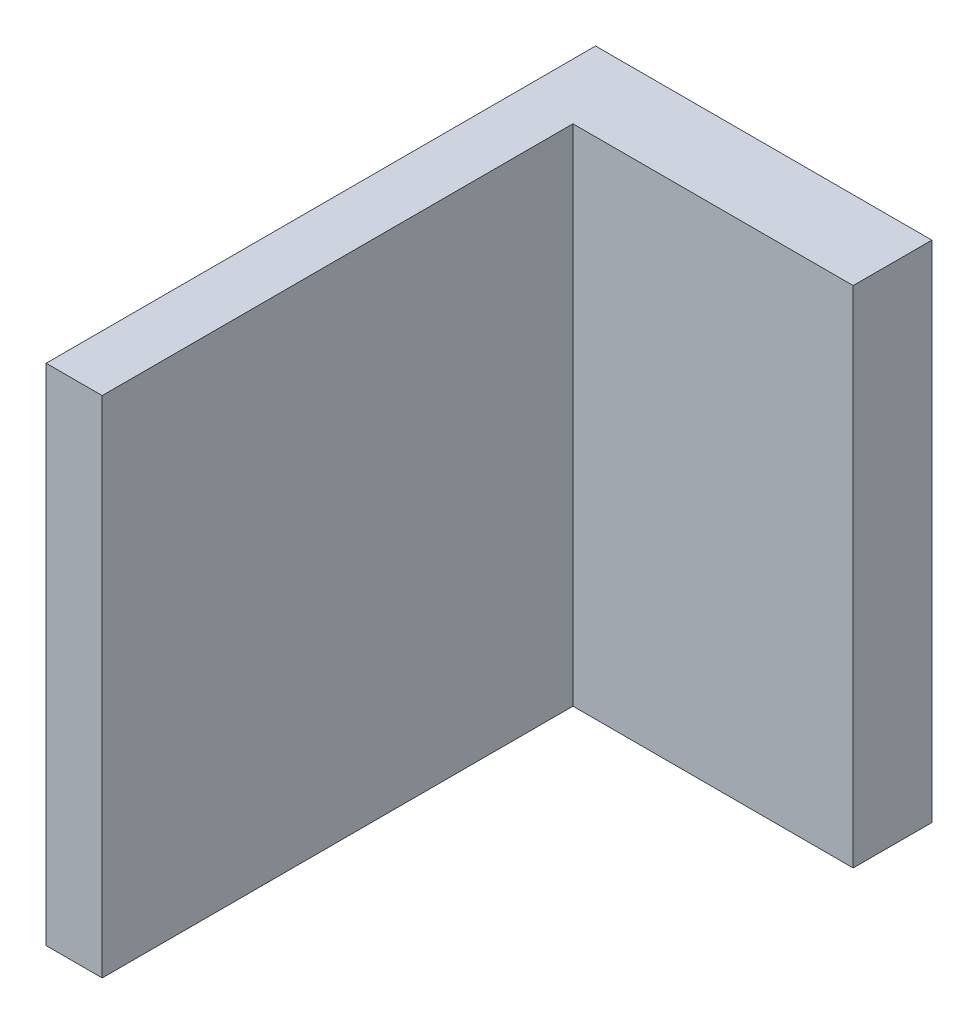
ISO-10303-21;
HEADER;
FILE_DESCRIPTION(('STEP AP214'),'2;1');
FILE_NAME('part.step','',(''),(''),'','','');
FILE_SCHEMA(('AUTOMOTIVE_DESIGN { 1 0 10303 214 1 1 1 1 }'));
ENDSEC;
DATA;
#1=APPLICATION_CONTEXT('core data for automotive mechanical design processes');
#2=APPLICATION_PROTOCOL_DEFINITION('international standard','automotive_design',2000,#1);
#3=PRODUCT_CONTEXT('',#1,'mechanical');
#4=PRODUCT('Part','Part','',(#3));
#5=PRODUCT_RELATED_PRODUCT_CATEGORY('part','',(#4));
#6=PRODUCT_DEFINITION_FORMATION('','',#4);
#7=PRODUCT_DEFINITION_CONTEXT('part definition',#1,'design');
#8=PRODUCT_DEFINITION('design','',#6,#7);
#9=PRODUCT_DEFINITION_SHAPE('','',#8);
#10=(LENGTH_UNIT() NAMED_UNIT(*) SI_UNIT(.MILLI.,.METRE.));
#11=(NAMED_UNIT(*) PLANE_ANGLE_UNIT() SI_UNIT($,.RADIAN.));
#12=(NAMED_UNIT(*) SI_UNIT($,.STERADIAN.) SOLID_ANGLE_UNIT());
#13=UNCERTAINTY_MEASURE_WITH_UNIT(LENGTH_MEASURE(1.E-05),#10,'distance_accuracy_value','');
#14=(GEOMETRIC_REPRESENTATION_CONTEXT(3) GLOBAL_UNCERTAINTY_ASSIGNED_CONTEXT((#13)) GLOBAL_UNIT_ASSIGNED_CONTEXT((#10,
#11,#12)) REPRESENTATION_CONTEXT('',''));
#15=CARTESIAN_POINT('',(0.,0.,0.));
#16=DIRECTION('',(0.,0.,1.));
#17=DIRECTION('',(1.,0.,0.));
#18=AXIS2_PLACEMENT_3D('',#15,#16,#17);
#19=CARTESIAN_POINT('',(1.22065899602321,22.5,10.746464433405));
#20=DIRECTION('',(0.,0.,-1.));
#21=DIRECTION('',(-1.,0.,0.));
#22=AXIS2_PLACEMENT_3D('',#19,#20,#21);
#23=PLANE('',#22);
#24=DIRECTION('',(1.,0.,0.));
#25=VECTOR('',#24,1.);
#26=CARTESIAN_POINT('',(1.22065899602321,0.,10.746464433405));
#27=LINE('',#26,#25);
#28=CARTESIAN_POINT('',(-1.27934100397679,0.,10.746464433405));
#29=VERTEX_POINT('',#28);
#30=CARTESIAN_POINT('',(1.22065899602321,0.,10.746464433405));
#31=VERTEX_POINT('',#30);
#32=EDGE_CURVE('E121',#29,#31,#27,.T.);
#33=ORIENTED_EDGE('',*,*,#32,.T.);
#34=DIRECTION('',(0.,-1.,0.));
#35=VECTOR('',#34,1.);
#36=CARTESIAN_POINT('',(1.22065899602321,22.5,10.746464433405));
#37=LINE('',#36,#35);
#38=CARTESIAN_POINT('',(1.22065899602321,22.5,10.746464433405));
#39=VERTEX_POINT('',#38);
#40=EDGE_CURVE('E41',#39,#31,#37,.T.);
#41=ORIENTED_EDGE('',*,*,#40,.F.);
#42=DIRECTION('',(1.,0.,0.));
#43=VECTOR('',#42,1.);
#44=CARTESIAN_POINT('',(1.22065899602321,22.5,10.746464433405));
#45=LINE('',#44,#43);
#46=CARTESIAN_POINT('',(-1.27934100397679,22.5,10.746464433405));
#47=VERTEX_POINT('',#46);
#48=EDGE_CURVE('E87',#47,#39,#45,.T.);
#49=ORIENTED_EDGE('',*,*,#48,.F.);
#50=DIRECTION('',(0.,-1.,0.));
#51=VECTOR('',#50,1.);
#52=CARTESIAN_POINT('',(-1.27934100397679,22.5,10.746464433405));
#53=LINE('',#52,#51);
#54=EDGE_CURVE('E11',#47,#29,#53,.T.);
#55=ORIENTED_EDGE('',*,*,#54,.T.);
#56=EDGE_LOOP('',(#33,#41,#49,#55));
#57=FACE_BOUND('',#56,.T.);
#58=ADVANCED_FACE('F33',(#57),#23,.F.);
#59=CARTESIAN_POINT('',(1.22065899602321,22.5,-10.253535566595));
#60=DIRECTION('',(-1.,0.,0.));
#61=DIRECTION('',(0.,0.,1.));
#62=AXIS2_PLACEMENT_3D('',#59,#60,#61);
#63=PLANE('',#62);
#64=DIRECTION('',(0.,0.,-1.));
#65=VECTOR('',#64,1.);
#66=CARTESIAN_POINT('',(1.22065899602321,0.,-10.253535566595));
#67=LINE('',#66,#65);
#68=CARTESIAN_POINT('',(1.22065899602321,0.,-10.253535566595));
#69=VERTEX_POINT('',#68);
#70=EDGE_CURVE('E123',#31,#69,#67,.T.);
#71=ORIENTED_EDGE('',*,*,#70,.T.);
#72=DIRECTION('',(0.,-1.,0.));
#73=VECTOR('',#72,1.);
#74=CARTESIAN_POINT('',(1.22065899602321,22.5,-10.253535566595));
#75=LINE('',#74,#73);
#76=CARTESIAN_POINT('',(1.22065899602321,22.5,-10.253535566595));
#77=VERTEX_POINT('',#76);
#78=EDGE_CURVE('E110',#77,#69,#75,.T.);
#79=ORIENTED_EDGE('',*,*,#78,.F.);
#80=DIRECTION('',(0.,0.,-1.));
#81=VECTOR('',#80,1.);
#82=CARTESIAN_POINT('',(1.22065899602321,22.5,-10.253535566595));
#83=LINE('',#82,#81);
#84=EDGE_CURVE('E101',#39,#77,#83,.T.);
#85=ORIENTED_EDGE('',*,*,#84,.F.);
#86=ORIENTED_EDGE('',*,*,#40,.T.);
#87=EDGE_LOOP('',(#71,#79,#85,#86));
#88=FACE_BOUND('',#87,.T.);
#89=ADVANCED_FACE('F135',(#88),#63,.F.);
#90=CARTESIAN_POINT('',(1.22065899602321,22.5,-10.253535566595));
#91=DIRECTION('',(0.,0.,-1.));
#92=DIRECTION('',(-1.,0.,0.));
#93=AXIS2_PLACEMENT_3D('',#90,#91,#92);
#94=PLANE('',#93);
#95=DIRECTION('',(1.,0.,0.));
#96=VECTOR('',#95,1.);
#97=CARTESIAN_POINT('',(1.22065899602321,0.,-10.253535566595));
#98=LINE('',#97,#96);
#99=CARTESIAN_POINT('',(13.7206589960232,0.,-10.253535566595));
#100=VERTEX_POINT('',#99);
#101=EDGE_CURVE('E109',#69,#100,#98,.T.);
#102=ORIENTED_EDGE('',*,*,#101,.T.);
#103=DIRECTION('',(0.,-1.,0.));
#104=VECTOR('',#103,1.);
#105=CARTESIAN_POINT('',(13.7206589960232,22.5,-10.253535566595));
#106=LINE('',#105,#104);
#107=CARTESIAN_POINT('',(13.7206589960232,22.5,-10.253535566595));
#108=VERTEX_POINT('',#107);
#109=EDGE_CURVE('E106',#108,#100,#106,.T.);
#110=ORIENTED_EDGE('',*,*,#109,.F.);
#111=DIRECTION('',(1.,0.,0.));
#112=VECTOR('',#111,1.);
#113=CARTESIAN_POINT('',(1.22065899602321,22.5,-10.253535566595));
#114=LINE('',#113,#112);
#115=EDGE_CURVE('E95',#77,#108,#114,.T.);
#116=ORIENTED_EDGE('',*,*,#115,.F.);
#117=ORIENTED_EDGE('',*,*,#78,.T.);
#118=EDGE_LOOP('',(#102,#110,#116,#117));
#119=FACE_BOUND('',#118,.T.);
#120=ADVANCED_FACE('F107',(#119),#94,.F.);
#121=CARTESIAN_POINT('',(13.7206589960232,22.5,-10.253535566595));
#122=DIRECTION('',(-1.,0.,0.));
#123=DIRECTION('',(0.,0.,1.));
#124=AXIS2_PLACEMENT_3D('',#121,#122,#123);
#125=PLANE('',#124);
#126=DIRECTION('',(0.,0.,-1.));
#127=VECTOR('',#126,1.);
#128=CARTESIAN_POINT('',(13.7206589960232,0.,-10.253535566595));
#129=LINE('',#128,#127);
#130=CARTESIAN_POINT('',(13.7206589960232,0.,-13.7630903816908));
#131=VERTEX_POINT('',#130);
#132=EDGE_CURVE('E73',#100,#131,#129,.T.);
#133=ORIENTED_EDGE('',*,*,#132,.T.);
#134=DIRECTION('',(0.,-1.,0.));
#135=VECTOR('',#134,1.);
#136=CARTESIAN_POINT('',(13.7206589960232,22.5,-13.7630903816908));
#137=LINE('',#136,#135);
#138=CARTESIAN_POINT('',(13.7206589960232,22.5,-13.7630903816908));
#139=VERTEX_POINT('',#138);
#140=EDGE_CURVE('E111',#139,#131,#137,.T.);
#141=ORIENTED_EDGE('',*,*,#140,.F.);
#142=DIRECTION('',(0.,0.,-1.));
#143=VECTOR('',#142,1.);
#144=CARTESIAN_POINT('',(13.7206589960232,22.5,-10.253535566595));
#145=LINE('',#144,#143);
#146=EDGE_CURVE('E99',#108,#139,#145,.T.);
#147=ORIENTED_EDGE('',*,*,#146,.F.);
#148=ORIENTED_EDGE('',*,*,#109,.T.);
#149=EDGE_LOOP('',(#133,#141,#147,#148));
#150=FACE_BOUND('',#149,.T.);
#151=ADVANCED_FACE('F113',(#150),#125,.F.);
#152=CARTESIAN_POINT('',(-1.27934100397679,22.5,-13.7630903816908));
#153=DIRECTION('',(0.,0.,1.));
#154=DIRECTION('',(1.,0.,0.));
#155=AXIS2_PLACEMENT_3D('',#152,#153,#154);
#156=PLANE('',#155);
#157=DIRECTION('',(-1.,0.,0.));
#158=VECTOR('',#157,1.);
#159=CARTESIAN_POINT('',(-1.27934100397679,0.,-13.7630903816908));
#160=LINE('',#159,#158);
#161=CARTESIAN_POINT('',(-1.27934100397679,0.,-13.7630903816908));
#162=VERTEX_POINT('',#161);
#163=EDGE_CURVE('E80',#131,#162,#160,.T.);
#164=ORIENTED_EDGE('',*,*,#163,.T.);
#165=DIRECTION('',(0.,-1.,0.));
#166=VECTOR('',#165,1.);
#167=CARTESIAN_POINT('',(-1.27934100397679,22.5,-13.7630903816908));
#168=LINE('',#167,#166);
#169=CARTESIAN_POINT('',(-1.27934100397679,22.5,-13.7630903816908));
#170=VERTEX_POINT('',#169);
#171=EDGE_CURVE('E117',#170,#162,#168,.T.);
#172=ORIENTED_EDGE('',*,*,#171,.F.);
#173=DIRECTION('',(-1.,0.,0.));
#174=VECTOR('',#173,1.);
#175=CARTESIAN_POINT('',(-1.27934100397679,22.5,-13.7630903816908));
#176=LINE('',#175,#174);
#177=EDGE_CURVE('E115',#139,#170,#176,.T.);
#178=ORIENTED_EDGE('',*,*,#177,.F.);
#179=ORIENTED_EDGE('',*,*,#140,.T.);
#180=EDGE_LOOP('',(#164,#172,#178,#179));
#181=FACE_BOUND('',#180,.T.);
#182=ADVANCED_FACE('F141',(#181),#156,.F.);
#183=CARTESIAN_POINT('',(-1.27934100397679,22.5,-11.2630903816908));
#184=DIRECTION('',(1.,0.,0.));
#185=DIRECTION('',(0.,0.,-1.));
#186=AXIS2_PLACEMENT_3D('',#183,#184,#185);
#187=PLANE('',#186);
#188=DIRECTION('',(0.,0.,1.));
#189=VECTOR('',#188,1.);
#190=CARTESIAN_POINT('',(-1.27934100397679,0.,-11.2630903816908));
#191=LINE('',#190,#189);
#192=EDGE_CURVE('E128',#162,#29,#191,.T.);
#193=ORIENTED_EDGE('',*,*,#192,.T.);
#194=ORIENTED_EDGE('',*,*,#54,.F.);
#195=DIRECTION('',(0.,0.,1.));
#196=VECTOR('',#195,1.);
#197=CARTESIAN_POINT('',(-1.27934100397679,22.5,-11.2630903816908));
#198=LINE('',#197,#196);
#199=EDGE_CURVE('E49',#170,#47,#198,.T.);
#200=ORIENTED_EDGE('',*,*,#199,.F.);
#201=ORIENTED_EDGE('',*,*,#171,.T.);
#202=EDGE_LOOP('',(#193,#194,#200,#201));
#203=FACE_BOUND('',#202,.T.);
#204=ADVANCED_FACE('F140',(#203),#187,.F.);
#205=CARTESIAN_POINT('',(0.,22.5,0.));
#206=DIRECTION('',(0.,-1.,0.));
#207=DIRECTION('',(0.,0.,-1.));
#208=AXIS2_PLACEMENT_3D('',#205,#206,#207);
#209=PLANE('',#208);
#210=ORIENTED_EDGE('',*,*,#199,.T.);
#211=ORIENTED_EDGE('',*,*,#48,.T.);
#212=ORIENTED_EDGE('',*,*,#84,.T.);
#213=ORIENTED_EDGE('',*,*,#115,.T.);
#214=ORIENTED_EDGE('',*,*,#146,.T.);
#215=ORIENTED_EDGE('',*,*,#177,.T.);
#216=EDGE_LOOP('',(#210,#211,#212,#213,#214,#215));
#217=FACE_BOUND('',#216,.T.);
#218=ADVANCED_FACE('F97',(#217),#209,.F.);
#219=CARTESIAN_POINT('',(0.,0.,0.));
#220=DIRECTION('',(0.,-1.,0.));
#221=DIRECTION('',(0.,0.,-1.));
#222=AXIS2_PLACEMENT_3D('',#219,#220,#221);
#223=PLANE('',#222);
#224=ORIENTED_EDGE('',*,*,#32,.F.);
#225=ORIENTED_EDGE('',*,*,#192,.F.);
#226=ORIENTED_EDGE('',*,*,#163,.F.);
#227=ORIENTED_EDGE('',*,*,#132,.F.);
#228=ORIENTED_EDGE('',*,*,#101,.F.);
#229=ORIENTED_EDGE('',*,*,#70,.F.);
#230=EDGE_LOOP('',(#224,#225,#226,#227,#228,#229));
#231=FACE_BOUND('',#230,.T.);
#232=ADVANCED_FACE('F138',(#231),#223,.T.);
#233=CLOSED_SHELL('',(#58,#89,#120,#151,#182,#204,#218,#232));
#234=MANIFOLD_SOLID_BREP('B2',#233);
#235=ADVANCED_BREP_SHAPE_REPRESENTATION('',(#18,#234),#14);
#236=SHAPE_DEFINITION_REPRESENTATION(#9,#235);
ENDSEC;
END-ISO-10303-21;
